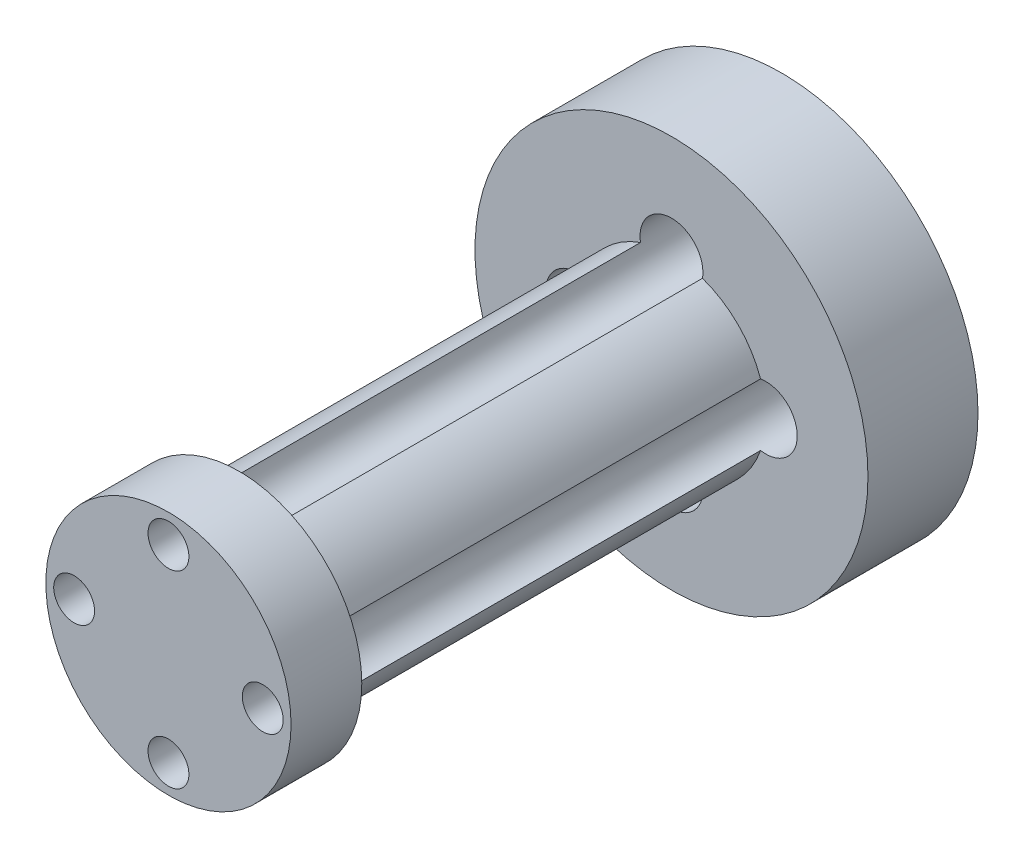
ISO-10303-21;
HEADER;
FILE_DESCRIPTION(('STEP AP214'),'2;1');
FILE_NAME('part.step','',(''),(''),'','','');
FILE_SCHEMA(('AUTOMOTIVE_DESIGN { 1 0 10303 214 1 1 1 1 }'));
ENDSEC;
DATA;
#1=APPLICATION_CONTEXT('core data for automotive mechanical design processes');
#2=APPLICATION_PROTOCOL_DEFINITION('international standard','automotive_design',2000,#1);
#3=PRODUCT_CONTEXT('',#1,'mechanical');
#4=PRODUCT('Part','Part','',(#3));
#5=PRODUCT_RELATED_PRODUCT_CATEGORY('part','',(#4));
#6=PRODUCT_DEFINITION_FORMATION('','',#4);
#7=PRODUCT_DEFINITION_CONTEXT('part definition',#1,'design');
#8=PRODUCT_DEFINITION('design','',#6,#7);
#9=PRODUCT_DEFINITION_SHAPE('','',#8);
#10=(LENGTH_UNIT() NAMED_UNIT(*) SI_UNIT(.MILLI.,.METRE.));
#11=(NAMED_UNIT(*) PLANE_ANGLE_UNIT() SI_UNIT($,.RADIAN.));
#12=(NAMED_UNIT(*) SI_UNIT($,.STERADIAN.) SOLID_ANGLE_UNIT());
#13=UNCERTAINTY_MEASURE_WITH_UNIT(LENGTH_MEASURE(1.E-05),#10,'distance_accuracy_value','');
#14=(GEOMETRIC_REPRESENTATION_CONTEXT(3) GLOBAL_UNCERTAINTY_ASSIGNED_CONTEXT((#13)) GLOBAL_UNIT_ASSIGNED_CONTEXT((#10,
#11,#12)) REPRESENTATION_CONTEXT('',''));
#15=CARTESIAN_POINT('',(0.,0.,0.));
#16=DIRECTION('',(0.,0.,1.));
#17=DIRECTION('',(1.,0.,0.));
#18=AXIS2_PLACEMENT_3D('',#15,#16,#17);
#19=CARTESIAN_POINT('',(0.,0.,34.5));
#20=DIRECTION('',(0.,0.,-1.));
#21=DIRECTION('',(-1.,0.,0.));
#22=AXIS2_PLACEMENT_3D('',#19,#20,#21);
#23=CYLINDRICAL_SURFACE('',#22,6.);
#24=CARTESIAN_POINT('',(0.,0.,7.));
#25=DIRECTION('',(0.,0.,1.));
#26=DIRECTION('',(1.,0.,0.));
#27=AXIS2_PLACEMENT_3D('',#24,#25,#26);
#28=CIRCLE('',#27,6.);
#29=CARTESIAN_POINT('',(5.66666666666667,1.97202659436652,7.));
#30=VERTEX_POINT('',#29);
#31=CARTESIAN_POINT('',(1.97202659436654,5.66666666666667,7.));
#32=VERTEX_POINT('',#31);
#33=EDGE_CURVE('E54',#30,#32,#28,.T.);
#34=ORIENTED_EDGE('',*,*,#33,.T.);
#35=DIRECTION('',(0.,0.,1.));
#36=VECTOR('',#35,1.);
#37=CARTESIAN_POINT('',(1.97202659436654,5.66666666666667,17.25));
#38=LINE('',#37,#36);
#39=CARTESIAN_POINT('',(1.97202659436654,5.66666666666667,34.5));
#40=VERTEX_POINT('',#39);
#41=EDGE_CURVE('E110',#32,#40,#38,.T.);
#42=ORIENTED_EDGE('',*,*,#41,.T.);
#43=CARTESIAN_POINT('',(0.,0.,34.5));
#44=DIRECTION('',(0.,0.,1.));
#45=DIRECTION('',(1.,0.,0.));
#46=AXIS2_PLACEMENT_3D('',#43,#44,#45);
#47=CIRCLE('',#46,6.);
#48=CARTESIAN_POINT('',(5.66666666666667,1.97202659436652,34.5));
#49=VERTEX_POINT('',#48);
#50=EDGE_CURVE('E114',#49,#40,#47,.T.);
#51=ORIENTED_EDGE('',*,*,#50,.F.);
#52=DIRECTION('',(0.,0.,1.));
#53=VECTOR('',#52,1.);
#54=CARTESIAN_POINT('',(5.66666666666667,1.97202659436652,17.25));
#55=LINE('',#54,#53);
#56=EDGE_CURVE('E162',#49,#30,#55,.F.);
#57=ORIENTED_EDGE('',*,*,#56,.T.);
#58=EDGE_LOOP('',(#34,#42,#51,#57));
#59=FACE_BOUND('',#58,.T.);
#60=ADVANCED_FACE('F45',(#59),#23,.T.);
#61=CARTESIAN_POINT('',(1.9720265943665,-5.66666666666668,7.));
#62=VERTEX_POINT('',#61);
#63=CARTESIAN_POINT('',(5.66666666666666,-1.97202659436656,7.));
#64=VERTEX_POINT('',#63);
#65=EDGE_CURVE('E195',#62,#64,#28,.T.);
#66=ORIENTED_EDGE('',*,*,#65,.T.);
#67=DIRECTION('',(0.,0.,1.));
#68=VECTOR('',#67,1.);
#69=CARTESIAN_POINT('',(5.66666666666666,-1.97202659436656,17.25));
#70=LINE('',#69,#68);
#71=CARTESIAN_POINT('',(5.66666666666666,-1.97202659436656,34.5));
#72=VERTEX_POINT('',#71);
#73=EDGE_CURVE('E174',#64,#72,#70,.T.);
#74=ORIENTED_EDGE('',*,*,#73,.T.);
#75=CARTESIAN_POINT('',(1.9720265943665,-5.66666666666668,34.5));
#76=VERTEX_POINT('',#75);
#77=EDGE_CURVE('E120',#76,#72,#47,.T.);
#78=ORIENTED_EDGE('',*,*,#77,.F.);
#79=DIRECTION('',(0.,0.,1.));
#80=VECTOR('',#79,1.);
#81=CARTESIAN_POINT('',(1.9720265943665,-5.66666666666668,17.25));
#82=LINE('',#81,#80);
#83=EDGE_CURVE('E61',#76,#62,#82,.F.);
#84=ORIENTED_EDGE('',*,*,#83,.T.);
#85=EDGE_LOOP('',(#66,#74,#78,#84));
#86=FACE_BOUND('',#85,.T.);
#87=ADVANCED_FACE('F204',(#86),#23,.T.);
#88=CARTESIAN_POINT('',(-5.66666666666669,-1.97202659436648,7.));
#89=VERTEX_POINT('',#88);
#90=CARTESIAN_POINT('',(-1.97202659436658,-5.66666666666665,7.));
#91=VERTEX_POINT('',#90);
#92=EDGE_CURVE('E159',#89,#91,#28,.T.);
#93=ORIENTED_EDGE('',*,*,#92,.T.);
#94=DIRECTION('',(0.,0.,1.));
#95=VECTOR('',#94,1.);
#96=CARTESIAN_POINT('',(-1.97202659436658,-5.66666666666665,17.25));
#97=LINE('',#96,#95);
#98=CARTESIAN_POINT('',(-1.97202659436658,-5.66666666666665,34.5));
#99=VERTEX_POINT('',#98);
#100=EDGE_CURVE('E158',#91,#99,#97,.T.);
#101=ORIENTED_EDGE('',*,*,#100,.T.);
#102=CARTESIAN_POINT('',(-5.66666666666669,-1.97202659436648,34.5));
#103=VERTEX_POINT('',#102);
#104=EDGE_CURVE('E145',#103,#99,#47,.T.);
#105=ORIENTED_EDGE('',*,*,#104,.F.);
#106=DIRECTION('',(0.,0.,1.));
#107=VECTOR('',#106,1.);
#108=CARTESIAN_POINT('',(-5.66666666666669,-1.97202659436648,17.25));
#109=LINE('',#108,#107);
#110=EDGE_CURVE('E68',#103,#89,#109,.F.);
#111=ORIENTED_EDGE('',*,*,#110,.T.);
#112=EDGE_LOOP('',(#93,#101,#105,#111));
#113=FACE_BOUND('',#112,.T.);
#114=ADVANCED_FACE('F156',(#113),#23,.T.);
#115=CARTESIAN_POINT('',(0.,0.,7.));
#116=DIRECTION('',(0.,0.,-1.));
#117=DIRECTION('',(-1.,0.,0.));
#118=AXIS2_PLACEMENT_3D('',#115,#116,#117);
#119=CYLINDRICAL_SURFACE('',#118,12.5);
#120=CARTESIAN_POINT('',(0.,0.,7.));
#121=DIRECTION('',(0.,0.,1.));
#122=DIRECTION('',(1.,0.,0.));
#123=AXIS2_PLACEMENT_3D('',#120,#121,#122);
#124=CIRCLE('',#123,12.5);
#125=CARTESIAN_POINT('',(12.5,0.,7.));
#126=VERTEX_POINT('',#125);
#127=EDGE_CURVE('E144',#126,#126,#124,.T.);
#128=ORIENTED_EDGE('',*,*,#127,.F.);
#129=EDGE_LOOP('',(#128));
#130=FACE_BOUND('',#129,.T.);
#131=CARTESIAN_POINT('',(0.,0.,0.));
#132=DIRECTION('',(0.,0.,1.));
#133=DIRECTION('',(1.,0.,0.));
#134=AXIS2_PLACEMENT_3D('',#131,#132,#133);
#135=CIRCLE('',#134,12.5);
#136=CARTESIAN_POINT('',(12.5,0.,0.));
#137=VERTEX_POINT('',#136);
#138=EDGE_CURVE('E138',#137,#137,#135,.T.);
#139=ORIENTED_EDGE('',*,*,#138,.T.);
#140=EDGE_LOOP('',(#139));
#141=FACE_BOUND('',#140,.T.);
#142=ADVANCED_FACE('F47',(#130,#141),#119,.T.);
#143=CARTESIAN_POINT('',(0.,0.,7.));
#144=DIRECTION('',(0.,0.,1.));
#145=DIRECTION('',(1.,0.,0.));
#146=AXIS2_PLACEMENT_3D('',#143,#144,#145);
#147=PLANE('',#146);
#148=CARTESIAN_POINT('',(0.,6.,7.));
#149=DIRECTION('',(0.,0.,1.));
#150=DIRECTION('',(1.,0.,0.));
#151=AXIS2_PLACEMENT_3D('',#148,#149,#150);
#152=CIRCLE('',#151,2.);
#153=CARTESIAN_POINT('',(-1.97202659436654,5.66666666666667,7.));
#154=VERTEX_POINT('',#153);
#155=EDGE_CURVE('E121',#32,#154,#152,.T.);
#156=ORIENTED_EDGE('',*,*,#155,.F.);
#157=ORIENTED_EDGE('',*,*,#33,.F.);
#158=CARTESIAN_POINT('',(6.,0.,7.));
#159=DIRECTION('',(0.,0.,1.));
#160=DIRECTION('',(1.,0.,0.));
#161=AXIS2_PLACEMENT_3D('',#158,#159,#160);
#162=CIRCLE('',#161,2.);
#163=EDGE_CURVE('E167',#64,#30,#162,.T.);
#164=ORIENTED_EDGE('',*,*,#163,.F.);
#165=ORIENTED_EDGE('',*,*,#65,.F.);
#166=CARTESIAN_POINT('',(0.,-6.,7.));
#167=DIRECTION('',(0.,0.,1.));
#168=DIRECTION('',(1.,0.,0.));
#169=AXIS2_PLACEMENT_3D('',#166,#167,#168);
#170=CIRCLE('',#169,2.);
#171=EDGE_CURVE('E163',#91,#62,#170,.T.);
#172=ORIENTED_EDGE('',*,*,#171,.F.);
#173=ORIENTED_EDGE('',*,*,#92,.F.);
#174=CARTESIAN_POINT('',(-6.,0.,7.));
#175=DIRECTION('',(0.,0.,1.));
#176=DIRECTION('',(1.,0.,0.));
#177=AXIS2_PLACEMENT_3D('',#174,#175,#176);
#178=CIRCLE('',#177,2.);
#179=CARTESIAN_POINT('',(-5.66666666666665,1.9720265943666,7.));
#180=VERTEX_POINT('',#179);
#181=EDGE_CURVE('E191',#180,#89,#178,.T.);
#182=ORIENTED_EDGE('',*,*,#181,.F.);
#183=EDGE_CURVE('E187',#154,#180,#28,.T.);
#184=ORIENTED_EDGE('',*,*,#183,.F.);
#185=EDGE_LOOP('',(#156,#157,#164,#165,#172,#173,#182,#184));
#186=FACE_BOUND('',#185,.T.);
#187=ORIENTED_EDGE('',*,*,#127,.T.);
#188=EDGE_LOOP('',(#187));
#189=FACE_BOUND('',#188,.T.);
#190=ADVANCED_FACE('F189',(#186,#189),#147,.T.);
#191=CARTESIAN_POINT('',(0.,0.,0.));
#192=DIRECTION('',(0.,0.,1.));
#193=DIRECTION('',(1.,0.,0.));
#194=AXIS2_PLACEMENT_3D('',#191,#192,#193);
#195=PLANE('',#194);
#196=CARTESIAN_POINT('',(5.72756492761107,-5.72756492761099,0.));
#197=DIRECTION('',(0.,0.,-1.));
#198=DIRECTION('',(-1.,0.,0.));
#199=AXIS2_PLACEMENT_3D('',#196,#197,#198);
#200=CIRCLE('',#199,2.07);
#201=CARTESIAN_POINT('',(3.65756492761107,-5.72756492761099,0.));
#202=VERTEX_POINT('',#201);
#203=EDGE_CURVE('E248',#202,#202,#200,.T.);
#204=ORIENTED_EDGE('',*,*,#203,.F.);
#205=EDGE_LOOP('',(#204));
#206=FACE_BOUND('',#205,.T.);
#207=CARTESIAN_POINT('',(-5.72756492761103,5.72756492761103,0.));
#208=DIRECTION('',(0.,0.,-1.));
#209=DIRECTION('',(-1.,0.,0.));
#210=AXIS2_PLACEMENT_3D('',#207,#208,#209);
#211=CIRCLE('',#210,2.07);
#212=CARTESIAN_POINT('',(-7.79756492761103,5.72756492761103,0.));
#213=VERTEX_POINT('',#212);
#214=EDGE_CURVE('E243',#213,#213,#211,.T.);
#215=ORIENTED_EDGE('',*,*,#214,.F.);
#216=EDGE_LOOP('',(#215));
#217=FACE_BOUND('',#216,.T.);
#218=CARTESIAN_POINT('',(0.,6.,0.));
#219=DIRECTION('',(0.,0.,1.));
#220=DIRECTION('',(1.,0.,0.));
#221=AXIS2_PLACEMENT_3D('',#218,#219,#220);
#222=CIRCLE('',#221,2.);
#223=CARTESIAN_POINT('',(2.,6.,0.));
#224=VERTEX_POINT('',#223);
#225=EDGE_CURVE('E132',#224,#224,#222,.T.);
#226=ORIENTED_EDGE('',*,*,#225,.T.);
#227=EDGE_LOOP('',(#226));
#228=FACE_BOUND('',#227,.T.);
#229=CARTESIAN_POINT('',(6.,0.,0.));
#230=DIRECTION('',(0.,0.,1.));
#231=DIRECTION('',(1.,0.,0.));
#232=AXIS2_PLACEMENT_3D('',#229,#230,#231);
#233=CIRCLE('',#232,2.);
#234=CARTESIAN_POINT('',(8.,0.,0.));
#235=VERTEX_POINT('',#234);
#236=EDGE_CURVE('E209',#235,#235,#233,.T.);
#237=ORIENTED_EDGE('',*,*,#236,.T.);
#238=EDGE_LOOP('',(#237));
#239=FACE_BOUND('',#238,.T.);
#240=CARTESIAN_POINT('',(0.,-6.,0.));
#241=DIRECTION('',(0.,0.,1.));
#242=DIRECTION('',(1.,0.,0.));
#243=AXIS2_PLACEMENT_3D('',#240,#241,#242);
#244=CIRCLE('',#243,2.);
#245=CARTESIAN_POINT('',(1.99999999999996,-6.,0.));
#246=VERTEX_POINT('',#245);
#247=EDGE_CURVE('E218',#246,#246,#244,.T.);
#248=ORIENTED_EDGE('',*,*,#247,.T.);
#249=EDGE_LOOP('',(#248));
#250=FACE_BOUND('',#249,.T.);
#251=CARTESIAN_POINT('',(-6.,0.,0.));
#252=DIRECTION('',(0.,0.,1.));
#253=DIRECTION('',(1.,0.,0.));
#254=AXIS2_PLACEMENT_3D('',#251,#252,#253);
#255=CIRCLE('',#254,2.);
#256=CARTESIAN_POINT('',(-4.,0.,0.));
#257=VERTEX_POINT('',#256);
#258=EDGE_CURVE('E222',#257,#257,#255,.T.);
#259=ORIENTED_EDGE('',*,*,#258,.T.);
#260=EDGE_LOOP('',(#259));
#261=FACE_BOUND('',#260,.T.);
#262=ORIENTED_EDGE('',*,*,#138,.F.);
#263=EDGE_LOOP('',(#262));
#264=FACE_BOUND('',#263,.T.);
#265=ADVANCED_FACE('F341',(#206,#217,#228,#239,#250,#261,#264),#195,.F.);
#266=CARTESIAN_POINT('',(-1.97202659436654,5.66666666666667,34.5));
#267=VERTEX_POINT('',#266);
#268=CARTESIAN_POINT('',(-5.66666666666665,1.9720265943666,34.5));
#269=VERTEX_POINT('',#268);
#270=EDGE_CURVE('E139',#267,#269,#47,.T.);
#271=ORIENTED_EDGE('',*,*,#270,.F.);
#272=DIRECTION('',(0.,0.,1.));
#273=VECTOR('',#272,1.);
#274=CARTESIAN_POINT('',(-1.97202659436654,5.66666666666667,17.25));
#275=LINE('',#274,#273);
#276=EDGE_CURVE('E127',#267,#154,#275,.F.);
#277=ORIENTED_EDGE('',*,*,#276,.T.);
#278=ORIENTED_EDGE('',*,*,#183,.T.);
#279=DIRECTION('',(0.,0.,1.));
#280=VECTOR('',#279,1.);
#281=CARTESIAN_POINT('',(-5.66666666666665,1.9720265943666,17.25));
#282=LINE('',#281,#280);
#283=EDGE_CURVE('E231',#180,#269,#282,.T.);
#284=ORIENTED_EDGE('',*,*,#283,.T.);
#285=EDGE_LOOP('',(#271,#277,#278,#284));
#286=FACE_BOUND('',#285,.T.);
#287=ADVANCED_FACE('F185',(#286),#23,.T.);
#288=CARTESIAN_POINT('',(-6.,0.,0.));
#289=DIRECTION('',(0.,0.,1.));
#290=DIRECTION('',(1.,0.,0.));
#291=AXIS2_PLACEMENT_3D('',#288,#289,#290);
#292=CYLINDRICAL_SURFACE('',#291,2.);
#293=ORIENTED_EDGE('',*,*,#258,.F.);
#294=EDGE_LOOP('',(#293));
#295=FACE_BOUND('',#294,.T.);
#296=ORIENTED_EDGE('',*,*,#181,.T.);
#297=ORIENTED_EDGE('',*,*,#110,.F.);
#298=CARTESIAN_POINT('',(-6.,0.,34.5));
#299=DIRECTION('',(0.,0.,1.));
#300=DIRECTION('',(1.,0.,0.));
#301=AXIS2_PLACEMENT_3D('',#298,#299,#300);
#302=CIRCLE('',#301,2.);
#303=EDGE_CURVE('E11',#103,#269,#302,.T.);
#304=ORIENTED_EDGE('',*,*,#303,.T.);
#305=ORIENTED_EDGE('',*,*,#283,.F.);
#306=EDGE_LOOP('',(#296,#297,#304,#305));
#307=FACE_BOUND('',#306,.T.);
#308=ADVANCED_FACE('F340',(#295,#307),#292,.F.);
#309=CARTESIAN_POINT('',(0.,-6.,0.));
#310=DIRECTION('',(0.,0.,1.));
#311=DIRECTION('',(1.,0.,0.));
#312=AXIS2_PLACEMENT_3D('',#309,#310,#311);
#313=CYLINDRICAL_SURFACE('',#312,2.);
#314=ORIENTED_EDGE('',*,*,#247,.F.);
#315=EDGE_LOOP('',(#314));
#316=FACE_BOUND('',#315,.T.);
#317=ORIENTED_EDGE('',*,*,#171,.T.);
#318=ORIENTED_EDGE('',*,*,#83,.F.);
#319=CARTESIAN_POINT('',(0.,-6.,34.5));
#320=DIRECTION('',(0.,0.,1.));
#321=DIRECTION('',(1.,0.,0.));
#322=AXIS2_PLACEMENT_3D('',#319,#320,#321);
#323=CIRCLE('',#322,2.);
#324=EDGE_CURVE('E152',#76,#99,#323,.T.);
#325=ORIENTED_EDGE('',*,*,#324,.T.);
#326=ORIENTED_EDGE('',*,*,#100,.F.);
#327=EDGE_LOOP('',(#317,#318,#325,#326));
#328=FACE_BOUND('',#327,.T.);
#329=ADVANCED_FACE('F346',(#316,#328),#313,.F.);
#330=CARTESIAN_POINT('',(6.,0.,0.));
#331=DIRECTION('',(0.,0.,1.));
#332=DIRECTION('',(1.,0.,0.));
#333=AXIS2_PLACEMENT_3D('',#330,#331,#332);
#334=CYLINDRICAL_SURFACE('',#333,2.);
#335=ORIENTED_EDGE('',*,*,#236,.F.);
#336=EDGE_LOOP('',(#335));
#337=FACE_BOUND('',#336,.T.);
#338=ORIENTED_EDGE('',*,*,#163,.T.);
#339=ORIENTED_EDGE('',*,*,#56,.F.);
#340=CARTESIAN_POINT('',(6.,0.,34.5));
#341=DIRECTION('',(0.,0.,1.));
#342=DIRECTION('',(1.,0.,0.));
#343=AXIS2_PLACEMENT_3D('',#340,#341,#342);
#344=CIRCLE('',#343,2.);
#345=EDGE_CURVE('E133',#49,#72,#344,.T.);
#346=ORIENTED_EDGE('',*,*,#345,.T.);
#347=ORIENTED_EDGE('',*,*,#73,.F.);
#348=EDGE_LOOP('',(#338,#339,#346,#347));
#349=FACE_BOUND('',#348,.T.);
#350=ADVANCED_FACE('F207',(#337,#349),#334,.F.);
#351=CARTESIAN_POINT('',(0.,6.,0.));
#352=DIRECTION('',(0.,0.,1.));
#353=DIRECTION('',(1.,0.,0.));
#354=AXIS2_PLACEMENT_3D('',#351,#352,#353);
#355=CYLINDRICAL_SURFACE('',#354,2.);
#356=ORIENTED_EDGE('',*,*,#225,.F.);
#357=EDGE_LOOP('',(#356));
#358=FACE_BOUND('',#357,.T.);
#359=ORIENTED_EDGE('',*,*,#155,.T.);
#360=ORIENTED_EDGE('',*,*,#276,.F.);
#361=CARTESIAN_POINT('',(0.,6.,34.5));
#362=DIRECTION('',(0.,0.,1.));
#363=DIRECTION('',(1.,0.,0.));
#364=AXIS2_PLACEMENT_3D('',#361,#362,#363);
#365=CIRCLE('',#364,2.);
#366=EDGE_CURVE('E124',#267,#40,#365,.T.);
#367=ORIENTED_EDGE('',*,*,#366,.T.);
#368=ORIENTED_EDGE('',*,*,#41,.F.);
#369=EDGE_LOOP('',(#359,#360,#367,#368));
#370=FACE_BOUND('',#369,.T.);
#371=ADVANCED_FACE('F125',(#358,#370),#355,.F.);
#372=CARTESIAN_POINT('',(-5.72756492761103,5.72756492761103,5.));
#373=DIRECTION('',(0.,0.,-1.));
#374=DIRECTION('',(-1.,0.,0.));
#375=AXIS2_PLACEMENT_3D('',#372,#373,#374);
#376=CYLINDRICAL_SURFACE('',#375,2.07);
#377=CARTESIAN_POINT('',(-5.72756492761103,5.72756492761103,5.));
#378=DIRECTION('',(0.,0.,-1.));
#379=DIRECTION('',(-1.,0.,0.));
#380=AXIS2_PLACEMENT_3D('',#377,#378,#379);
#381=CIRCLE('',#380,2.07);
#382=CARTESIAN_POINT('',(-7.79756492761103,5.72756492761103,5.));
#383=VERTEX_POINT('',#382);
#384=EDGE_CURVE('E239',#383,#383,#381,.T.);
#385=ORIENTED_EDGE('',*,*,#384,.F.);
#386=EDGE_LOOP('',(#385));
#387=FACE_BOUND('',#386,.T.);
#388=ORIENTED_EDGE('',*,*,#214,.T.);
#389=EDGE_LOOP('',(#388));
#390=FACE_BOUND('',#389,.T.);
#391=ADVANCED_FACE('F371',(#387,#390),#376,.F.);
#392=CARTESIAN_POINT('',(-5.72756492761103,5.72756492761103,5.));
#393=DIRECTION('',(0.,0.,-1.));
#394=DIRECTION('',(-1.,0.,0.));
#395=AXIS2_PLACEMENT_3D('',#392,#393,#394);
#396=PLANE('',#395);
#397=ORIENTED_EDGE('',*,*,#384,.T.);
#398=EDGE_LOOP('',(#397));
#399=FACE_BOUND('',#398,.T.);
#400=ADVANCED_FACE('F375',(#399),#396,.T.);
#401=CARTESIAN_POINT('',(5.72756492761107,-5.72756492761099,5.));
#402=DIRECTION('',(0.,0.,-1.));
#403=DIRECTION('',(-1.,0.,0.));
#404=AXIS2_PLACEMENT_3D('',#401,#402,#403);
#405=CYLINDRICAL_SURFACE('',#404,2.07);
#406=CARTESIAN_POINT('',(5.72756492761107,-5.72756492761099,5.));
#407=DIRECTION('',(0.,0.,-1.));
#408=DIRECTION('',(-1.,0.,0.));
#409=AXIS2_PLACEMENT_3D('',#406,#407,#408);
#410=CIRCLE('',#409,2.07);
#411=CARTESIAN_POINT('',(3.65756492761107,-5.72756492761099,5.));
#412=VERTEX_POINT('',#411);
#413=EDGE_CURVE('E226',#412,#412,#410,.T.);
#414=ORIENTED_EDGE('',*,*,#413,.F.);
#415=EDGE_LOOP('',(#414));
#416=FACE_BOUND('',#415,.T.);
#417=ORIENTED_EDGE('',*,*,#203,.T.);
#418=EDGE_LOOP('',(#417));
#419=FACE_BOUND('',#418,.T.);
#420=ADVANCED_FACE('F329',(#416,#419),#405,.F.);
#421=CARTESIAN_POINT('',(5.72756492761107,-5.72756492761099,5.));
#422=DIRECTION('',(0.,0.,-1.));
#423=DIRECTION('',(-1.,0.,0.));
#424=AXIS2_PLACEMENT_3D('',#421,#422,#423);
#425=PLANE('',#424);
#426=ORIENTED_EDGE('',*,*,#413,.T.);
#427=EDGE_LOOP('',(#426));
#428=FACE_BOUND('',#427,.T.);
#429=ADVANCED_FACE('F324',(#428),#425,.T.);
#430=CARTESIAN_POINT('',(0.,0.,34.5));
#431=DIRECTION('',(0.,0.,1.));
#432=DIRECTION('',(1.,0.,0.));
#433=AXIS2_PLACEMENT_3D('',#430,#431,#432);
#434=PLANE('',#433);
#435=CARTESIAN_POINT('',(-6.,0.,34.5));
#436=DIRECTION('',(0.,0.,1.));
#437=DIRECTION('',(1.,0.,0.));
#438=AXIS2_PLACEMENT_3D('',#435,#436,#437);
#439=CIRCLE('',#438,1.3);
#440=CARTESIAN_POINT('',(-4.7,0.,34.5));
#441=VERTEX_POINT('',#440);
#442=EDGE_CURVE('E259',#441,#441,#439,.T.);
#443=ORIENTED_EDGE('',*,*,#442,.T.);
#444=EDGE_LOOP('',(#443));
#445=FACE_BOUND('',#444,.T.);
#446=CARTESIAN_POINT('',(0.,6.,34.5));
#447=DIRECTION('',(0.,0.,1.));
#448=DIRECTION('',(1.,0.,0.));
#449=AXIS2_PLACEMENT_3D('',#446,#447,#448);
#450=CIRCLE('',#449,1.3);
#451=CARTESIAN_POINT('',(1.30000000000002,6.,34.5));
#452=VERTEX_POINT('',#451);
#453=EDGE_CURVE('E279',#452,#452,#450,.T.);
#454=ORIENTED_EDGE('',*,*,#453,.T.);
#455=EDGE_LOOP('',(#454));
#456=FACE_BOUND('',#455,.T.);
#457=CARTESIAN_POINT('',(6.,0.,34.5));
#458=DIRECTION('',(0.,0.,1.));
#459=DIRECTION('',(1.,0.,0.));
#460=AXIS2_PLACEMENT_3D('',#457,#458,#459);
#461=CIRCLE('',#460,1.3);
#462=CARTESIAN_POINT('',(7.3,0.,34.5));
#463=VERTEX_POINT('',#462);
#464=EDGE_CURVE('E271',#463,#463,#461,.T.);
#465=ORIENTED_EDGE('',*,*,#464,.T.);
#466=EDGE_LOOP('',(#465));
#467=FACE_BOUND('',#466,.T.);
#468=CARTESIAN_POINT('',(0.,-6.,34.5));
#469=DIRECTION('',(0.,0.,1.));
#470=DIRECTION('',(1.,0.,0.));
#471=AXIS2_PLACEMENT_3D('',#468,#469,#470);
#472=CIRCLE('',#471,1.3);
#473=CARTESIAN_POINT('',(1.29999999999994,-6.,34.5));
#474=VERTEX_POINT('',#473);
#475=EDGE_CURVE('E263',#474,#474,#472,.T.);
#476=ORIENTED_EDGE('',*,*,#475,.T.);
#477=EDGE_LOOP('',(#476));
#478=FACE_BOUND('',#477,.T.);
#479=CARTESIAN_POINT('',(0.,0.,34.5));
#480=DIRECTION('',(0.,0.,1.));
#481=DIRECTION('',(1.,0.,0.));
#482=AXIS2_PLACEMENT_3D('',#479,#480,#481);
#483=CIRCLE('',#482,7.8);
#484=CARTESIAN_POINT('',(7.8,0.,34.5));
#485=VERTEX_POINT('',#484);
#486=EDGE_CURVE('E255',#485,#485,#483,.T.);
#487=ORIENTED_EDGE('',*,*,#486,.F.);
#488=EDGE_LOOP('',(#487));
#489=FACE_BOUND('',#488,.T.);
#490=ORIENTED_EDGE('',*,*,#366,.F.);
#491=ORIENTED_EDGE('',*,*,#270,.T.);
#492=ORIENTED_EDGE('',*,*,#303,.F.);
#493=ORIENTED_EDGE('',*,*,#104,.T.);
#494=ORIENTED_EDGE('',*,*,#324,.F.);
#495=ORIENTED_EDGE('',*,*,#77,.T.);
#496=ORIENTED_EDGE('',*,*,#345,.F.);
#497=ORIENTED_EDGE('',*,*,#50,.T.);
#498=EDGE_LOOP('',(#490,#491,#492,#493,#494,#495,#496,#497));
#499=FACE_BOUND('',#498,.T.);
#500=ADVANCED_FACE('F135',(#445,#456,#467,#478,#489,#499),#434,.F.);
#501=CARTESIAN_POINT('',(0.,0.,39.));
#502=DIRECTION('',(0.,0.,-1.));
#503=DIRECTION('',(-1.,0.,0.));
#504=AXIS2_PLACEMENT_3D('',#501,#502,#503);
#505=CYLINDRICAL_SURFACE('',#504,7.8);
#506=CARTESIAN_POINT('',(0.,0.,39.));
#507=DIRECTION('',(0.,0.,1.));
#508=DIRECTION('',(1.,0.,0.));
#509=AXIS2_PLACEMENT_3D('',#506,#507,#508);
#510=CIRCLE('',#509,7.8);
#511=CARTESIAN_POINT('',(7.8,0.,39.));
#512=VERTEX_POINT('',#511);
#513=EDGE_CURVE('E244',#512,#512,#510,.T.);
#514=ORIENTED_EDGE('',*,*,#513,.F.);
#515=EDGE_LOOP('',(#514));
#516=FACE_BOUND('',#515,.T.);
#517=ORIENTED_EDGE('',*,*,#486,.T.);
#518=EDGE_LOOP('',(#517));
#519=FACE_BOUND('',#518,.T.);
#520=ADVANCED_FACE('F308',(#516,#519),#505,.T.);
#521=CARTESIAN_POINT('',(0.,0.,39.));
#522=DIRECTION('',(0.,0.,1.));
#523=DIRECTION('',(1.,0.,0.));
#524=AXIS2_PLACEMENT_3D('',#521,#522,#523);
#525=PLANE('',#524);
#526=CARTESIAN_POINT('',(-6.,0.,39.));
#527=DIRECTION('',(0.,0.,1.));
#528=DIRECTION('',(1.,0.,0.));
#529=AXIS2_PLACEMENT_3D('',#526,#527,#528);
#530=CIRCLE('',#529,1.3);
#531=CARTESIAN_POINT('',(-4.7,0.,39.));
#532=VERTEX_POINT('',#531);
#533=EDGE_CURVE('E287',#532,#532,#530,.T.);
#534=ORIENTED_EDGE('',*,*,#533,.F.);
#535=EDGE_LOOP('',(#534));
#536=FACE_BOUND('',#535,.T.);
#537=CARTESIAN_POINT('',(0.,6.,39.));
#538=DIRECTION('',(0.,0.,1.));
#539=DIRECTION('',(1.,0.,0.));
#540=AXIS2_PLACEMENT_3D('',#537,#538,#539);
#541=CIRCLE('',#540,1.3);
#542=CARTESIAN_POINT('',(1.30000000000002,6.,39.));
#543=VERTEX_POINT('',#542);
#544=EDGE_CURVE('E283',#543,#543,#541,.T.);
#545=ORIENTED_EDGE('',*,*,#544,.F.);
#546=EDGE_LOOP('',(#545));
#547=FACE_BOUND('',#546,.T.);
#548=CARTESIAN_POINT('',(6.,0.,39.));
#549=DIRECTION('',(0.,0.,1.));
#550=DIRECTION('',(1.,0.,0.));
#551=AXIS2_PLACEMENT_3D('',#548,#549,#550);
#552=CIRCLE('',#551,1.3);
#553=CARTESIAN_POINT('',(7.3,0.,39.));
#554=VERTEX_POINT('',#553);
#555=EDGE_CURVE('E275',#554,#554,#552,.T.);
#556=ORIENTED_EDGE('',*,*,#555,.F.);
#557=EDGE_LOOP('',(#556));
#558=FACE_BOUND('',#557,.T.);
#559=CARTESIAN_POINT('',(0.,-6.,39.));
#560=DIRECTION('',(0.,0.,1.));
#561=DIRECTION('',(1.,0.,0.));
#562=AXIS2_PLACEMENT_3D('',#559,#560,#561);
#563=CIRCLE('',#562,1.3);
#564=CARTESIAN_POINT('',(1.29999999999994,-6.,39.));
#565=VERTEX_POINT('',#564);
#566=EDGE_CURVE('E267',#565,#565,#563,.T.);
#567=ORIENTED_EDGE('',*,*,#566,.F.);
#568=EDGE_LOOP('',(#567));
#569=FACE_BOUND('',#568,.T.);
#570=ORIENTED_EDGE('',*,*,#513,.T.);
#571=EDGE_LOOP('',(#570));
#572=FACE_BOUND('',#571,.T.);
#573=ADVANCED_FACE('F304',(#536,#547,#558,#569,#572),#525,.T.);
#574=CARTESIAN_POINT('',(0.,-6.,34.5));
#575=DIRECTION('',(0.,0.,1.));
#576=DIRECTION('',(1.,0.,0.));
#577=AXIS2_PLACEMENT_3D('',#574,#575,#576);
#578=CYLINDRICAL_SURFACE('',#577,1.3);
#579=ORIENTED_EDGE('',*,*,#475,.F.);
#580=EDGE_LOOP('',(#579));
#581=FACE_BOUND('',#580,.T.);
#582=ORIENTED_EDGE('',*,*,#566,.T.);
#583=EDGE_LOOP('',(#582));
#584=FACE_BOUND('',#583,.T.);
#585=ADVANCED_FACE('F307',(#581,#584),#578,.F.);
#586=CARTESIAN_POINT('',(6.,0.,34.5));
#587=DIRECTION('',(0.,0.,1.));
#588=DIRECTION('',(1.,0.,0.));
#589=AXIS2_PLACEMENT_3D('',#586,#587,#588);
#590=CYLINDRICAL_SURFACE('',#589,1.3);
#591=ORIENTED_EDGE('',*,*,#464,.F.);
#592=EDGE_LOOP('',(#591));
#593=FACE_BOUND('',#592,.T.);
#594=ORIENTED_EDGE('',*,*,#555,.T.);
#595=EDGE_LOOP('',(#594));
#596=FACE_BOUND('',#595,.T.);
#597=ADVANCED_FACE('F426',(#593,#596),#590,.F.);
#598=CARTESIAN_POINT('',(0.,6.,34.5));
#599=DIRECTION('',(0.,0.,1.));
#600=DIRECTION('',(1.,0.,0.));
#601=AXIS2_PLACEMENT_3D('',#598,#599,#600);
#602=CYLINDRICAL_SURFACE('',#601,1.3);
#603=ORIENTED_EDGE('',*,*,#453,.F.);
#604=EDGE_LOOP('',(#603));
#605=FACE_BOUND('',#604,.T.);
#606=ORIENTED_EDGE('',*,*,#544,.T.);
#607=EDGE_LOOP('',(#606));
#608=FACE_BOUND('',#607,.T.);
#609=ADVANCED_FACE('F300',(#605,#608),#602,.F.);
#610=CARTESIAN_POINT('',(-6.,0.,34.5));
#611=DIRECTION('',(0.,0.,1.));
#612=DIRECTION('',(1.,0.,0.));
#613=AXIS2_PLACEMENT_3D('',#610,#611,#612);
#614=CYLINDRICAL_SURFACE('',#613,1.3);
#615=ORIENTED_EDGE('',*,*,#442,.F.);
#616=EDGE_LOOP('',(#615));
#617=FACE_BOUND('',#616,.T.);
#618=ORIENTED_EDGE('',*,*,#533,.T.);
#619=EDGE_LOOP('',(#618));
#620=FACE_BOUND('',#619,.T.);
#621=ADVANCED_FACE('F297',(#617,#620),#614,.F.);
#622=CLOSED_SHELL('',(#60,#87,#114,#142,#190,#265,#287,#308,#329,#350,#371,#391,#400,#420,#429,
#500,#520,#573,#585,#597,#609,#621));
#623=MANIFOLD_SOLID_BREP('B2',#622);
#624=ADVANCED_BREP_SHAPE_REPRESENTATION('',(#18,#623),#14);
#625=SHAPE_DEFINITION_REPRESENTATION(#9,#624);
ENDSEC;
END-ISO-10303-21;
